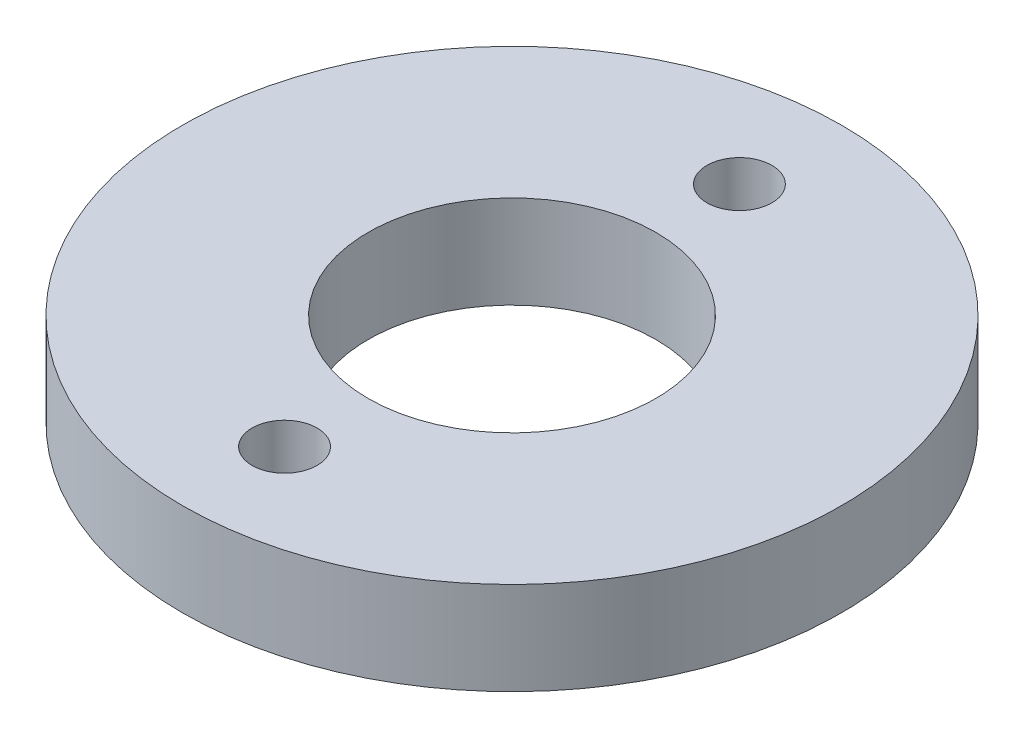
ISO-10303-21;
HEADER;
FILE_DESCRIPTION(('STEP AP214'),'2;1');
FILE_NAME('part.step','',(''),(''),'','','');
FILE_SCHEMA(('AUTOMOTIVE_DESIGN { 1 0 10303 214 1 1 1 1 }'));
ENDSEC;
DATA;
#1=APPLICATION_CONTEXT('core data for automotive mechanical design processes');
#2=APPLICATION_PROTOCOL_DEFINITION('international standard','automotive_design',2000,#1);
#3=PRODUCT_CONTEXT('',#1,'mechanical');
#4=PRODUCT('Part','Part','',(#3));
#5=PRODUCT_RELATED_PRODUCT_CATEGORY('part','',(#4));
#6=PRODUCT_DEFINITION_FORMATION('','',#4);
#7=PRODUCT_DEFINITION_CONTEXT('part definition',#1,'design');
#8=PRODUCT_DEFINITION('design','',#6,#7);
#9=PRODUCT_DEFINITION_SHAPE('','',#8);
#10=(LENGTH_UNIT() NAMED_UNIT(*) SI_UNIT(.MILLI.,.METRE.));
#11=(NAMED_UNIT(*) PLANE_ANGLE_UNIT() SI_UNIT($,.RADIAN.));
#12=(NAMED_UNIT(*) SI_UNIT($,.STERADIAN.) SOLID_ANGLE_UNIT());
#13=UNCERTAINTY_MEASURE_WITH_UNIT(LENGTH_MEASURE(1.E-05),#10,'distance_accuracy_value','');
#14=(GEOMETRIC_REPRESENTATION_CONTEXT(3) GLOBAL_UNCERTAINTY_ASSIGNED_CONTEXT((#13)) GLOBAL_UNIT_ASSIGNED_CONTEXT((#10,
#11,#12)) REPRESENTATION_CONTEXT('',''));
#15=CARTESIAN_POINT('',(0.,0.,0.));
#16=DIRECTION('',(0.,0.,1.));
#17=DIRECTION('',(1.,0.,0.));
#18=AXIS2_PLACEMENT_3D('',#15,#16,#17);
#19=CARTESIAN_POINT('',(0.,3.,0.));
#20=DIRECTION('',(0.,1.,0.));
#21=DIRECTION('',(0.,0.,1.));
#22=AXIS2_PLACEMENT_3D('',#19,#20,#21);
#23=PLANE('',#22);
#24=CARTESIAN_POINT('',(0.,3.,-7.35));
#25=DIRECTION('',(0.,1.,0.));
#26=DIRECTION('',(0.,0.,1.));
#27=AXIS2_PLACEMENT_3D('',#24,#25,#26);
#28=CIRCLE('',#27,1.05);
#29=CARTESIAN_POINT('',(0.,3.,-6.3));
#30=VERTEX_POINT('',#29);
#31=EDGE_CURVE('E56',#30,#30,#28,.T.);
#32=ORIENTED_EDGE('',*,*,#31,.F.);
#33=EDGE_LOOP('',(#32));
#34=FACE_BOUND('',#33,.T.);
#35=CARTESIAN_POINT('',(0.,3.,7.35));
#36=DIRECTION('',(0.,1.,0.));
#37=DIRECTION('',(0.,0.,1.));
#38=AXIS2_PLACEMENT_3D('',#35,#36,#37);
#39=CIRCLE('',#38,1.05);
#40=CARTESIAN_POINT('',(0.,3.,8.4));
#41=VERTEX_POINT('',#40);
#42=EDGE_CURVE('E50',#41,#41,#39,.T.);
#43=ORIENTED_EDGE('',*,*,#42,.F.);
#44=EDGE_LOOP('',(#43));
#45=FACE_BOUND('',#44,.T.);
#46=CARTESIAN_POINT('',(0.,3.,0.));
#47=DIRECTION('',(0.,1.,0.));
#48=DIRECTION('',(0.,0.,1.));
#49=AXIS2_PLACEMENT_3D('',#46,#47,#48);
#50=CIRCLE('',#49,10.65);
#51=CARTESIAN_POINT('',(0.,3.,10.65));
#52=VERTEX_POINT('',#51);
#53=EDGE_CURVE('E10',#52,#52,#50,.T.);
#54=ORIENTED_EDGE('',*,*,#53,.T.);
#55=EDGE_LOOP('',(#54));
#56=FACE_BOUND('',#55,.T.);
#57=CARTESIAN_POINT('',(0.,3.,0.));
#58=DIRECTION('',(0.,1.,0.));
#59=DIRECTION('',(0.,0.,1.));
#60=AXIS2_PLACEMENT_3D('',#57,#58,#59);
#61=CIRCLE('',#60,4.65);
#62=CARTESIAN_POINT('',(0.,3.,4.65));
#63=VERTEX_POINT('',#62);
#64=EDGE_CURVE('E42',#63,#63,#61,.T.);
#65=ORIENTED_EDGE('',*,*,#64,.F.);
#66=EDGE_LOOP('',(#65));
#67=FACE_BOUND('',#66,.T.);
#68=ADVANCED_FACE('F31',(#34,#45,#56,#67),#23,.T.);
#69=CARTESIAN_POINT('',(0.,0.,0.));
#70=DIRECTION('',(0.,1.,0.));
#71=DIRECTION('',(0.,0.,1.));
#72=AXIS2_PLACEMENT_3D('',#69,#70,#71);
#73=PLANE('',#72);
#74=CARTESIAN_POINT('',(0.,0.,-7.35));
#75=DIRECTION('',(0.,1.,0.));
#76=DIRECTION('',(0.,0.,1.));
#77=AXIS2_PLACEMENT_3D('',#74,#75,#76);
#78=CIRCLE('',#77,1.05);
#79=CARTESIAN_POINT('',(0.,0.,-6.3));
#80=VERTEX_POINT('',#79);
#81=EDGE_CURVE('E47',#80,#80,#78,.T.);
#82=ORIENTED_EDGE('',*,*,#81,.T.);
#83=EDGE_LOOP('',(#82));
#84=FACE_BOUND('',#83,.T.);
#85=CARTESIAN_POINT('',(0.,0.,7.35));
#86=DIRECTION('',(0.,1.,0.));
#87=DIRECTION('',(0.,0.,1.));
#88=AXIS2_PLACEMENT_3D('',#85,#86,#87);
#89=CIRCLE('',#88,1.05);
#90=CARTESIAN_POINT('',(0.,0.,8.4));
#91=VERTEX_POINT('',#90);
#92=EDGE_CURVE('E53',#91,#91,#89,.T.);
#93=ORIENTED_EDGE('',*,*,#92,.T.);
#94=EDGE_LOOP('',(#93));
#95=FACE_BOUND('',#94,.T.);
#96=CARTESIAN_POINT('',(0.,0.,0.));
#97=DIRECTION('',(0.,1.,0.));
#98=DIRECTION('',(0.,0.,1.));
#99=AXIS2_PLACEMENT_3D('',#96,#97,#98);
#100=CIRCLE('',#99,10.65);
#101=CARTESIAN_POINT('',(0.,0.,10.65));
#102=VERTEX_POINT('',#101);
#103=EDGE_CURVE('E35',#102,#102,#100,.T.);
#104=ORIENTED_EDGE('',*,*,#103,.F.);
#105=EDGE_LOOP('',(#104));
#106=FACE_BOUND('',#105,.T.);
#107=CARTESIAN_POINT('',(0.,0.,0.));
#108=DIRECTION('',(0.,1.,0.));
#109=DIRECTION('',(0.,0.,1.));
#110=AXIS2_PLACEMENT_3D('',#107,#108,#109);
#111=CIRCLE('',#110,4.65);
#112=CARTESIAN_POINT('',(0.,0.,4.65));
#113=VERTEX_POINT('',#112);
#114=EDGE_CURVE('E44',#113,#113,#111,.T.);
#115=ORIENTED_EDGE('',*,*,#114,.T.);
#116=EDGE_LOOP('',(#115));
#117=FACE_BOUND('',#116,.T.);
#118=ADVANCED_FACE('F62',(#84,#95,#106,#117),#73,.F.);
#119=CARTESIAN_POINT('',(0.,3.,0.));
#120=DIRECTION('',(0.,-1.,0.));
#121=DIRECTION('',(0.,0.,-1.));
#122=AXIS2_PLACEMENT_3D('',#119,#120,#121);
#123=CYLINDRICAL_SURFACE('',#122,10.65);
#124=ORIENTED_EDGE('',*,*,#53,.F.);
#125=EDGE_LOOP('',(#124));
#126=FACE_BOUND('',#125,.T.);
#127=ORIENTED_EDGE('',*,*,#103,.T.);
#128=EDGE_LOOP('',(#127));
#129=FACE_BOUND('',#128,.T.);
#130=ADVANCED_FACE('F33',(#126,#129),#123,.T.);
#131=CARTESIAN_POINT('',(0.,3.,0.));
#132=DIRECTION('',(0.,-1.,0.));
#133=DIRECTION('',(0.,0.,-1.));
#134=AXIS2_PLACEMENT_3D('',#131,#132,#133);
#135=CYLINDRICAL_SURFACE('',#134,4.65);
#136=ORIENTED_EDGE('',*,*,#64,.T.);
#137=EDGE_LOOP('',(#136));
#138=FACE_BOUND('',#137,.T.);
#139=ORIENTED_EDGE('',*,*,#114,.F.);
#140=EDGE_LOOP('',(#139));
#141=FACE_BOUND('',#140,.T.);
#142=ADVANCED_FACE('F79',(#138,#141),#135,.F.);
#143=CARTESIAN_POINT('',(0.,0.,7.35));
#144=DIRECTION('',(0.,1.,0.));
#145=DIRECTION('',(0.,0.,1.));
#146=AXIS2_PLACEMENT_3D('',#143,#144,#145);
#147=CYLINDRICAL_SURFACE('',#146,1.05);
#148=ORIENTED_EDGE('',*,*,#92,.F.);
#149=EDGE_LOOP('',(#148));
#150=FACE_BOUND('',#149,.T.);
#151=ORIENTED_EDGE('',*,*,#42,.T.);
#152=EDGE_LOOP('',(#151));
#153=FACE_BOUND('',#152,.T.);
#154=ADVANCED_FACE('F68',(#150,#153),#147,.F.);
#155=CARTESIAN_POINT('',(0.,0.,-7.35));
#156=DIRECTION('',(0.,1.,0.));
#157=DIRECTION('',(0.,0.,1.));
#158=AXIS2_PLACEMENT_3D('',#155,#156,#157);
#159=CYLINDRICAL_SURFACE('',#158,1.05);
#160=ORIENTED_EDGE('',*,*,#81,.F.);
#161=EDGE_LOOP('',(#160));
#162=FACE_BOUND('',#161,.T.);
#163=ORIENTED_EDGE('',*,*,#31,.T.);
#164=EDGE_LOOP('',(#163));
#165=FACE_BOUND('',#164,.T.);
#166=ADVANCED_FACE('F65',(#162,#165),#159,.F.);
#167=CLOSED_SHELL('',(#68,#118,#130,#142,#154,#166));
#168=MANIFOLD_SOLID_BREP('B2',#167);
#169=ADVANCED_BREP_SHAPE_REPRESENTATION('',(#18,#168),#14);
#170=SHAPE_DEFINITION_REPRESENTATION(#9,#169);
ENDSEC;
END-ISO-10303-21;
